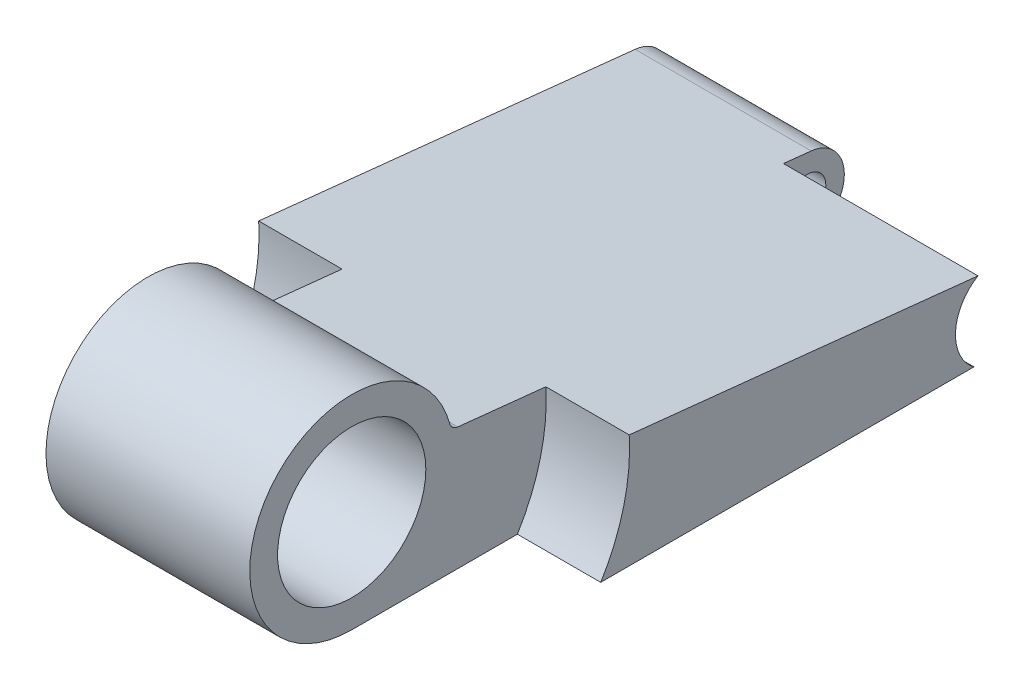
ISO-10303-21;
HEADER;
FILE_DESCRIPTION(('STEP AP214'),'2;1');
FILE_NAME('part.step','',(''),(''),'','','');
FILE_SCHEMA(('AUTOMOTIVE_DESIGN { 1 0 10303 214 1 1 1 1 }'));
ENDSEC;
DATA;
#1=APPLICATION_CONTEXT('core data for automotive mechanical design processes');
#2=APPLICATION_PROTOCOL_DEFINITION('international standard','automotive_design',2000,#1);
#3=PRODUCT_CONTEXT('',#1,'mechanical');
#4=PRODUCT('Part','Part','',(#3));
#5=PRODUCT_RELATED_PRODUCT_CATEGORY('part','',(#4));
#6=PRODUCT_DEFINITION_FORMATION('','',#4);
#7=PRODUCT_DEFINITION_CONTEXT('part definition',#1,'design');
#8=PRODUCT_DEFINITION('design','',#6,#7);
#9=PRODUCT_DEFINITION_SHAPE('','',#8);
#10=(LENGTH_UNIT() NAMED_UNIT(*) SI_UNIT(.MILLI.,.METRE.));
#11=(NAMED_UNIT(*) PLANE_ANGLE_UNIT() SI_UNIT($,.RADIAN.));
#12=(NAMED_UNIT(*) SI_UNIT($,.STERADIAN.) SOLID_ANGLE_UNIT());
#13=UNCERTAINTY_MEASURE_WITH_UNIT(LENGTH_MEASURE(1.E-05),#10,'distance_accuracy_value','');
#14=(GEOMETRIC_REPRESENTATION_CONTEXT(3) GLOBAL_UNCERTAINTY_ASSIGNED_CONTEXT((#13)) GLOBAL_UNIT_ASSIGNED_CONTEXT((#10,
#11,#12)) REPRESENTATION_CONTEXT('',''));
#15=CARTESIAN_POINT('',(0.,0.,0.));
#16=DIRECTION('',(0.,0.,1.));
#17=DIRECTION('',(1.,0.,0.));
#18=AXIS2_PLACEMENT_3D('',#15,#16,#17);
#19=CARTESIAN_POINT('',(-15.68196,-2.74447324027126,-17.8828513810992));
#20=DIRECTION('',(1.,0.,0.));
#21=DIRECTION('',(0.,0.,-1.));
#22=AXIS2_PLACEMENT_3D('',#19,#20,#21);
#23=CYLINDRICAL_SURFACE('',#22,1.56844676235245);
#24=DIRECTION('',(1.,0.,0.));
#25=VECTOR('',#24,1.);
#26=CARTESIAN_POINT('',(-15.68196,-1.18460826102359,-18.0467003751472));
#27=LINE('',#26,#25);
#28=CARTESIAN_POINT('',(-15.68196,-1.18460826102359,-18.0467003751472));
#29=VERTEX_POINT('',#28);
#30=CARTESIAN_POINT('',(-8.23214,-1.18460826102359,-18.0467003751472));
#31=VERTEX_POINT('',#30);
#32=EDGE_CURVE('E154',#29,#31,#27,.T.);
#33=ORIENTED_EDGE('',*,*,#32,.T.);
#34=CARTESIAN_POINT('',(-8.23214,-2.74447324027126,-17.8828513810992));
#35=DIRECTION('',(1.,0.,0.));
#36=DIRECTION('',(0.,0.,-1.));
#37=AXIS2_PLACEMENT_3D('',#34,#35,#36);
#38=CIRCLE('',#37,1.56844676235245);
#39=CARTESIAN_POINT('',(-8.23214,-4.31292000262371,-17.8828513810992));
#40=VERTEX_POINT('',#39);
#41=EDGE_CURVE('E221',#31,#40,#38,.F.);
#42=ORIENTED_EDGE('',*,*,#41,.T.);
#43=DIRECTION('',(1.,0.,0.));
#44=VECTOR('',#43,1.);
#45=CARTESIAN_POINT('',(-15.68196,-4.31292000262371,-17.8828513810992));
#46=LINE('',#45,#44);
#47=CARTESIAN_POINT('',(-15.68196,-4.31292000262371,-17.8828513810992));
#48=VERTEX_POINT('',#47);
#49=EDGE_CURVE('E149',#48,#40,#46,.T.);
#50=ORIENTED_EDGE('',*,*,#49,.F.);
#51=CARTESIAN_POINT('',(-15.68196,-2.74447324027126,-17.8828513810992));
#52=DIRECTION('',(1.,0.,0.));
#53=DIRECTION('',(0.,0.,-1.));
#54=AXIS2_PLACEMENT_3D('',#51,#52,#53);
#55=CIRCLE('',#54,1.56844676235245);
#56=EDGE_CURVE('E139',#48,#29,#55,.T.);
#57=ORIENTED_EDGE('',*,*,#56,.T.);
#58=EDGE_LOOP('',(#33,#42,#50,#57));
#59=FACE_BOUND('',#58,.T.);
#60=ADVANCED_FACE('F32',(#59),#23,.T.);
#61=CARTESIAN_POINT('',(-15.68196,-2.74447324027126,-17.8828513810992));
#62=DIRECTION('',(1.,0.,0.));
#63=DIRECTION('',(0.,0.,-1.));
#64=AXIS2_PLACEMENT_3D('',#61,#62,#63);
#65=CYLINDRICAL_SURFACE('',#64,0.78486);
#66=CARTESIAN_POINT('',(-15.68196,-2.74447324027126,-17.8828513810992));
#67=DIRECTION('',(1.,0.,0.));
#68=DIRECTION('',(0.,0.,-1.));
#69=AXIS2_PLACEMENT_3D('',#66,#67,#68);
#70=CIRCLE('',#69,0.78486);
#71=CARTESIAN_POINT('',(-15.68196,-2.74447324027126,-18.6677113810992));
#72=VERTEX_POINT('',#71);
#73=EDGE_CURVE('E145',#72,#72,#70,.T.);
#74=ORIENTED_EDGE('',*,*,#73,.F.);
#75=EDGE_LOOP('',(#74));
#76=FACE_BOUND('',#75,.T.);
#77=CARTESIAN_POINT('',(-8.23214,-2.74447324027126,-17.8828513810992));
#78=DIRECTION('',(1.,0.,0.));
#79=DIRECTION('',(0.,0.,-1.));
#80=AXIS2_PLACEMENT_3D('',#77,#78,#79);
#81=CIRCLE('',#80,0.78486);
#82=CARTESIAN_POINT('',(-8.23214,-2.74447324027126,-18.6677113810992));
#83=VERTEX_POINT('',#82);
#84=EDGE_CURVE('E36',#83,#83,#81,.F.);
#85=ORIENTED_EDGE('',*,*,#84,.F.);
#86=EDGE_LOOP('',(#85));
#87=FACE_BOUND('',#86,.T.);
#88=ADVANCED_FACE('F256',(#76,#87),#65,.F.);
#89=CARTESIAN_POINT('',(-15.68196,-2.62370724094478E-09,6.10208116404841));
#90=DIRECTION('',(1.,0.,0.));
#91=DIRECTION('',(0.,0.,-1.));
#92=AXIS2_PLACEMENT_3D('',#89,#90,#91);
#93=CYLINDRICAL_SURFACE('',#92,4.31292);
#94=DIRECTION('',(1.,0.,0.));
#95=VECTOR('',#94,1.);
#96=CARTESIAN_POINT('',(-15.68196,1.16479746069526,1.94942830161869));
#97=LINE('',#96,#95);
#98=CARTESIAN_POINT('',(-3.52806,1.16479746069526,1.94942830161869));
#99=VERTEX_POINT('',#98);
#100=CARTESIAN_POINT('',(-12.1539,1.16479746069526,1.94942830161869));
#101=VERTEX_POINT('',#100);
#102=EDGE_CURVE('E159',#99,#101,#97,.F.);
#103=ORIENTED_EDGE('',*,*,#102,.T.);
#104=CARTESIAN_POINT('',(-12.1539,-2.62370724094478E-09,6.10208116404841));
#105=DIRECTION('',(-1.,0.,0.));
#106=DIRECTION('',(0.,0.,1.));
#107=AXIS2_PLACEMENT_3D('',#104,#105,#106);
#108=CIRCLE('',#107,4.31292);
#109=CARTESIAN_POINT('',(-12.1539,-4.31292000262371,6.10208116404841));
#110=VERTEX_POINT('',#109);
#111=EDGE_CURVE('E186',#101,#110,#108,.F.);
#112=ORIENTED_EDGE('',*,*,#111,.T.);
#113=DIRECTION('',(1.,0.,0.));
#114=VECTOR('',#113,1.);
#115=CARTESIAN_POINT('',(-15.68196,-4.31292000262371,6.10208116404841));
#116=LINE('',#115,#114);
#117=CARTESIAN_POINT('',(-3.52806,-4.31292000262371,6.10208116404841));
#118=VERTEX_POINT('',#117);
#119=EDGE_CURVE('E152',#110,#118,#116,.T.);
#120=ORIENTED_EDGE('',*,*,#119,.T.);
#121=CARTESIAN_POINT('',(-3.52806,-2.62370724094478E-09,6.10208116404841));
#122=DIRECTION('',(1.,0.,0.));
#123=DIRECTION('',(0.,0.,-1.));
#124=AXIS2_PLACEMENT_3D('',#121,#122,#123);
#125=CIRCLE('',#124,4.31292);
#126=EDGE_CURVE('E170',#118,#99,#125,.F.);
#127=ORIENTED_EDGE('',*,*,#126,.T.);
#128=EDGE_LOOP('',(#103,#112,#120,#127));
#129=FACE_BOUND('',#128,.T.);
#130=ADVANCED_FACE('F178',(#129),#93,.T.);
#131=CARTESIAN_POINT('',(-15.68196,-2.62370724094478E-09,6.10208116404841));
#132=DIRECTION('',(1.,0.,0.));
#133=DIRECTION('',(0.,0.,-1.));
#134=AXIS2_PLACEMENT_3D('',#131,#132,#133);
#135=CYLINDRICAL_SURFACE('',#134,3.1369);
#136=CARTESIAN_POINT('',(-3.52806,-2.62370724094478E-09,6.10208116404841));
#137=DIRECTION('',(1.,0.,0.));
#138=DIRECTION('',(0.,0.,-1.));
#139=AXIS2_PLACEMENT_3D('',#136,#137,#138);
#140=CIRCLE('',#139,3.1369);
#141=CARTESIAN_POINT('',(-3.52806,-2.62370724094478E-09,2.96518116404841));
#142=VERTEX_POINT('',#141);
#143=EDGE_CURVE('E204',#142,#142,#140,.F.);
#144=ORIENTED_EDGE('',*,*,#143,.F.);
#145=EDGE_LOOP('',(#144));
#146=FACE_BOUND('',#145,.T.);
#147=CARTESIAN_POINT('',(-12.1539,-2.62370724094478E-09,6.10208116404841));
#148=DIRECTION('',(-1.,0.,0.));
#149=DIRECTION('',(0.,0.,1.));
#150=AXIS2_PLACEMENT_3D('',#147,#148,#149);
#151=CIRCLE('',#150,3.1369);
#152=CARTESIAN_POINT('',(-12.1539,-2.62370724094478E-09,9.23898116404841));
#153=VERTEX_POINT('',#152);
#154=EDGE_CURVE('E196',#153,#153,#151,.F.);
#155=ORIENTED_EDGE('',*,*,#154,.F.);
#156=EDGE_LOOP('',(#155));
#157=FACE_BOUND('',#156,.T.);
#158=ADVANCED_FACE('F267',(#146,#157),#135,.F.);
#159=CARTESIAN_POINT('',(-15.68196,1.27043869117295,1.57280371927819));
#160=DIRECTION('',(1.,0.,0.));
#161=DIRECTION('',(0.,0.,-1.));
#162=AXIS2_PLACEMENT_3D('',#159,#160,#161);
#163=CYLINDRICAL_SURFACE('',#162,0.39116);
#164=CARTESIAN_POINT('',(-12.1539,1.27043869117295,1.57280371927819));
#165=DIRECTION('',(-1.,0.,0.));
#166=DIRECTION('',(0.,0.,1.));
#167=AXIS2_PLACEMENT_3D('',#164,#165,#166);
#168=CIRCLE('',#167,0.39116);
#169=CARTESIAN_POINT('',(-12.1539,0.881420764820467,1.61368401497687));
#170=VERTEX_POINT('',#169);
#171=EDGE_CURVE('E184',#101,#170,#168,.F.);
#172=ORIENTED_EDGE('',*,*,#171,.F.);
#173=ORIENTED_EDGE('',*,*,#102,.F.);
#174=CARTESIAN_POINT('',(-3.52806,1.27043869117295,1.57280371927819));
#175=DIRECTION('',(1.,0.,0.));
#176=DIRECTION('',(0.,0.,-1.));
#177=AXIS2_PLACEMENT_3D('',#174,#175,#176);
#178=CIRCLE('',#177,0.39116);
#179=CARTESIAN_POINT('',(-3.52806,0.881420764820466,1.61368401497687));
#180=VERTEX_POINT('',#179);
#181=EDGE_CURVE('E41',#180,#99,#178,.F.);
#182=ORIENTED_EDGE('',*,*,#181,.F.);
#183=DIRECTION('',(-1.,0.,0.));
#184=VECTOR('',#183,1.);
#185=CARTESIAN_POINT('',(0.,0.881420764820466,1.61368401497687));
#186=LINE('',#185,#184);
#187=EDGE_CURVE('E151',#170,#180,#186,.F.);
#188=ORIENTED_EDGE('',*,*,#187,.F.);
#189=EDGE_LOOP('',(#172,#173,#182,#188));
#190=FACE_BOUND('',#189,.T.);
#191=ADVANCED_FACE('F34',(#190),#163,.F.);
#192=CARTESIAN_POINT('',(-15.68196,-4.31292000262371,6.10208116404841));
#193=DIRECTION('',(0.,-1.,0.));
#194=DIRECTION('',(0.,0.,-1.));
#195=AXIS2_PLACEMENT_3D('',#192,#193,#194);
#196=PLANE('',#195);
#197=DIRECTION('',(1.,0.,0.));
#198=VECTOR('',#197,1.);
#199=CARTESIAN_POINT('',(-8.23214,-4.31292000262371,-16.7059804756613));
#200=LINE('',#199,#198);
#201=CARTESIAN_POINT('',(0.,-4.31292000262371,-16.7059804756613));
#202=VERTEX_POINT('',#201);
#203=CARTESIAN_POINT('',(-8.23214,-4.31292000262371,-16.7059804756613));
#204=VERTEX_POINT('',#203);
#205=EDGE_CURVE('E118',#202,#204,#200,.F.);
#206=ORIENTED_EDGE('',*,*,#205,.F.);
#207=DIRECTION('',(0.,0.,-1.));
#208=VECTOR('',#207,1.);
#209=CARTESIAN_POINT('',(0.,-4.31292000262371,6.10208116404841));
#210=LINE('',#209,#208);
#211=CARTESIAN_POINT('',(0.,-4.31292000262371,-0.909826568744426));
#212=VERTEX_POINT('',#211);
#213=EDGE_CURVE('E130',#212,#202,#210,.T.);
#214=ORIENTED_EDGE('',*,*,#213,.F.);
#215=DIRECTION('',(1.,0.,0.));
#216=VECTOR('',#215,1.);
#217=CARTESIAN_POINT('',(-3.52806,-4.31292000262371,-0.909826568744426));
#218=LINE('',#217,#216);
#219=CARTESIAN_POINT('',(-3.52806,-4.31292000262371,-0.909826568744426));
#220=VERTEX_POINT('',#219);
#221=EDGE_CURVE('E209',#220,#212,#218,.T.);
#222=ORIENTED_EDGE('',*,*,#221,.F.);
#223=DIRECTION('',(0.,0.,1.));
#224=VECTOR('',#223,1.);
#225=CARTESIAN_POINT('',(-3.52806,-4.31292000262371,6.10208116404841));
#226=LINE('',#225,#224);
#227=EDGE_CURVE('E181',#220,#118,#226,.T.);
#228=ORIENTED_EDGE('',*,*,#227,.T.);
#229=ORIENTED_EDGE('',*,*,#119,.F.);
#230=DIRECTION('',(0.,0.,-1.));
#231=VECTOR('',#230,1.);
#232=CARTESIAN_POINT('',(-12.1539,-4.31292000262371,6.10208116404841));
#233=LINE('',#232,#231);
#234=CARTESIAN_POINT('',(-12.1539,-4.31292000262371,-0.909826568744426));
#235=VERTEX_POINT('',#234);
#236=EDGE_CURVE('E189',#110,#235,#233,.T.);
#237=ORIENTED_EDGE('',*,*,#236,.T.);
#238=DIRECTION('',(-1.,0.,0.));
#239=VECTOR('',#238,1.);
#240=CARTESIAN_POINT('',(-12.1539,-4.31292000262371,-0.909826568744426));
#241=LINE('',#240,#239);
#242=CARTESIAN_POINT('',(-15.68196,-4.31292000262371,-0.909826568744426));
#243=VERTEX_POINT('',#242);
#244=EDGE_CURVE('E187',#243,#235,#241,.F.);
#245=ORIENTED_EDGE('',*,*,#244,.F.);
#246=DIRECTION('',(0.,0.,-1.));
#247=VECTOR('',#246,1.);
#248=CARTESIAN_POINT('',(-15.68196,-4.31292000262371,6.10208116404841));
#249=LINE('',#248,#247);
#250=EDGE_CURVE('E157',#243,#48,#249,.T.);
#251=ORIENTED_EDGE('',*,*,#250,.T.);
#252=ORIENTED_EDGE('',*,*,#49,.T.);
#253=DIRECTION('',(0.,0.,1.));
#254=VECTOR('',#253,1.);
#255=CARTESIAN_POINT('',(-8.23214,-4.31292000262371,6.10208116404841));
#256=LINE('',#255,#254);
#257=EDGE_CURVE('E132',#40,#204,#256,.T.);
#258=ORIENTED_EDGE('',*,*,#257,.T.);
#259=EDGE_LOOP('',(#206,#214,#222,#228,#229,#237,#245,#251,#252,#258));
#260=FACE_BOUND('',#259,.T.);
#261=ADVANCED_FACE('F128',(#260),#196,.T.);
#262=CARTESIAN_POINT('',(-15.68196,-1.18460826102359,-18.0467003751472));
#263=DIRECTION('',(0.,0.994523791677285,-0.104510419518038));
#264=DIRECTION('',(0.,0.104510419518038,0.994523791677285));
#265=AXIS2_PLACEMENT_3D('',#262,#263,#264);
#266=PLANE('',#265);
#267=DIRECTION('',(1.,0.,0.));
#268=VECTOR('',#267,1.);
#269=CARTESIAN_POINT('',(-8.23214,-1.06162034843868,-16.876344292773));
#270=LINE('',#269,#268);
#271=CARTESIAN_POINT('',(-8.23214,-1.06162034843868,-16.876344292773));
#272=VERTEX_POINT('',#271);
#273=CARTESIAN_POINT('',(0.,-1.06162034843869,-16.876344292773));
#274=VERTEX_POINT('',#273);
#275=EDGE_CURVE('E48',#272,#274,#270,.T.);
#276=ORIENTED_EDGE('',*,*,#275,.F.);
#277=DIRECTION('',(0.,-0.104510419518038,-0.994523791677285));
#278=VECTOR('',#277,1.);
#279=CARTESIAN_POINT('',(-8.23214,-1.18460826102359,-18.0467003751472));
#280=LINE('',#279,#278);
#281=EDGE_CURVE('E227',#272,#31,#280,.T.);
#282=ORIENTED_EDGE('',*,*,#281,.T.);
#283=ORIENTED_EDGE('',*,*,#32,.F.);
#284=DIRECTION('',(0.,0.104510419518038,0.994523791677285));
#285=VECTOR('',#284,1.);
#286=CARTESIAN_POINT('',(-15.68196,-1.18460826102359,-18.0467003751472));
#287=LINE('',#286,#285);
#288=CARTESIAN_POINT('',(-15.68196,0.489537146244621,-2.11549039691033));
#289=VERTEX_POINT('',#288);
#290=EDGE_CURVE('E143',#29,#289,#287,.T.);
#291=ORIENTED_EDGE('',*,*,#290,.T.);
#292=DIRECTION('',(-1.,0.,0.));
#293=VECTOR('',#292,1.);
#294=CARTESIAN_POINT('',(-12.1539,0.489537146244622,-2.11549039691033));
#295=LINE('',#294,#293);
#296=CARTESIAN_POINT('',(-12.1539,0.489537146244622,-2.11549039691033));
#297=VERTEX_POINT('',#296);
#298=EDGE_CURVE('E56',#297,#289,#295,.T.);
#299=ORIENTED_EDGE('',*,*,#298,.F.);
#300=DIRECTION('',(0.,0.104510419518038,0.994523791677285));
#301=VECTOR('',#300,1.);
#302=CARTESIAN_POINT('',(-12.1539,-1.18460826102359,-18.0467003751472));
#303=LINE('',#302,#301);
#304=EDGE_CURVE('E11',#297,#170,#303,.T.);
#305=ORIENTED_EDGE('',*,*,#304,.T.);
#306=ORIENTED_EDGE('',*,*,#187,.T.);
#307=DIRECTION('',(0.,-0.104510419518038,-0.994523791677285));
#308=VECTOR('',#307,1.);
#309=CARTESIAN_POINT('',(-3.52806,-1.18460826102359,-18.0467003751472));
#310=LINE('',#309,#308);
#311=CARTESIAN_POINT('',(-3.52806,0.489537146244622,-2.11549039691033));
#312=VERTEX_POINT('',#311);
#313=EDGE_CURVE('E173',#180,#312,#310,.T.);
#314=ORIENTED_EDGE('',*,*,#313,.T.);
#315=DIRECTION('',(1.,0.,0.));
#316=VECTOR('',#315,1.);
#317=CARTESIAN_POINT('',(-3.52806,0.489537146244622,-2.11549039691033));
#318=LINE('',#317,#316);
#319=CARTESIAN_POINT('',(0.,0.489537146244621,-2.11549039691033));
#320=VERTEX_POINT('',#319);
#321=EDGE_CURVE('E207',#320,#312,#318,.F.);
#322=ORIENTED_EDGE('',*,*,#321,.F.);
#323=DIRECTION('',(0.,0.104510419518038,0.994523791677285));
#324=VECTOR('',#323,1.);
#325=CARTESIAN_POINT('',(0.,-1.18460826102359,-18.0467003751472));
#326=LINE('',#325,#324);
#327=EDGE_CURVE('E140',#274,#320,#326,.T.);
#328=ORIENTED_EDGE('',*,*,#327,.F.);
#329=EDGE_LOOP('',(#276,#282,#283,#291,#299,#305,#306,#314,#322,#328));
#330=FACE_BOUND('',#329,.T.);
#331=ADVANCED_FACE('F225',(#330),#266,.T.);
#332=CARTESIAN_POINT('',(-15.68196,-2.74447324027126,-17.8828513810992));
#333=DIRECTION('',(1.,0.,0.));
#334=DIRECTION('',(0.,0.,-1.));
#335=AXIS2_PLACEMENT_3D('',#332,#333,#334);
#336=PLANE('',#335);
#337=ORIENTED_EDGE('',*,*,#73,.T.);
#338=EDGE_LOOP('',(#337));
#339=FACE_BOUND('',#338,.T.);
#340=ORIENTED_EDGE('',*,*,#250,.F.);
#341=CARTESIAN_POINT('',(-15.68196,-2.62370724094478E-09,6.10208116404841));
#342=DIRECTION('',(-1.,0.,0.));
#343=DIRECTION('',(0.,0.,1.));
#344=AXIS2_PLACEMENT_3D('',#341,#342,#343);
#345=CIRCLE('',#344,8.23214);
#346=EDGE_CURVE('E133',#289,#243,#345,.T.);
#347=ORIENTED_EDGE('',*,*,#346,.F.);
#348=ORIENTED_EDGE('',*,*,#290,.F.);
#349=ORIENTED_EDGE('',*,*,#56,.F.);
#350=EDGE_LOOP('',(#340,#347,#348,#349));
#351=FACE_BOUND('',#350,.T.);
#352=ADVANCED_FACE('F223',(#339,#351),#336,.F.);
#353=CARTESIAN_POINT('',(0.,-2.74447324027126,-17.8828513810992));
#354=DIRECTION('',(1.,0.,0.));
#355=DIRECTION('',(0.,0.,-1.));
#356=AXIS2_PLACEMENT_3D('',#353,#354,#355);
#357=PLANE('',#356);
#358=CARTESIAN_POINT('',(0.,-2.74447324027126,-17.8828513810992));
#359=DIRECTION('',(1.,0.,0.));
#360=DIRECTION('',(0.,0.,-1.));
#361=AXIS2_PLACEMENT_3D('',#358,#359,#360);
#362=CIRCLE('',#361,1.96088);
#363=EDGE_CURVE('E115',#274,#202,#362,.T.);
#364=ORIENTED_EDGE('',*,*,#363,.F.);
#365=ORIENTED_EDGE('',*,*,#327,.T.);
#366=CARTESIAN_POINT('',(0.,-2.62370724094478E-09,6.10208116404841));
#367=DIRECTION('',(1.,0.,0.));
#368=DIRECTION('',(0.,0.,-1.));
#369=AXIS2_PLACEMENT_3D('',#366,#367,#368);
#370=CIRCLE('',#369,8.23214);
#371=EDGE_CURVE('E138',#212,#320,#370,.T.);
#372=ORIENTED_EDGE('',*,*,#371,.F.);
#373=ORIENTED_EDGE('',*,*,#213,.T.);
#374=EDGE_LOOP('',(#364,#365,#372,#373));
#375=FACE_BOUND('',#374,.T.);
#376=ADVANCED_FACE('F136',(#375),#357,.T.);
#377=CARTESIAN_POINT('',(-3.52806,-2.62370724094478E-09,6.10208116404841));
#378=DIRECTION('',(1.,0.,0.));
#379=DIRECTION('',(0.,0.,-1.));
#380=AXIS2_PLACEMENT_3D('',#377,#378,#379);
#381=PLANE('',#380);
#382=CARTESIAN_POINT('',(-3.52806,-2.62370724094478E-09,6.10208116404841));
#383=DIRECTION('',(1.,0.,0.));
#384=DIRECTION('',(0.,0.,-1.));
#385=AXIS2_PLACEMENT_3D('',#382,#383,#384);
#386=CIRCLE('',#385,8.23214);
#387=EDGE_CURVE('E199',#220,#312,#386,.T.);
#388=ORIENTED_EDGE('',*,*,#387,.T.);
#389=ORIENTED_EDGE('',*,*,#313,.F.);
#390=ORIENTED_EDGE('',*,*,#181,.T.);
#391=ORIENTED_EDGE('',*,*,#126,.F.);
#392=ORIENTED_EDGE('',*,*,#227,.F.);
#393=EDGE_LOOP('',(#388,#389,#390,#391,#392));
#394=FACE_BOUND('',#393,.T.);
#395=ORIENTED_EDGE('',*,*,#143,.T.);
#396=EDGE_LOOP('',(#395));
#397=FACE_BOUND('',#396,.T.);
#398=ADVANCED_FACE('F168',(#394,#397),#381,.T.);
#399=CARTESIAN_POINT('',(-3.52806,-2.62370724094478E-09,6.10208116404841));
#400=DIRECTION('',(1.,0.,0.));
#401=DIRECTION('',(0.,0.,-1.));
#402=AXIS2_PLACEMENT_3D('',#399,#400,#401);
#403=CYLINDRICAL_SURFACE('',#402,8.23214);
#404=ORIENTED_EDGE('',*,*,#221,.T.);
#405=ORIENTED_EDGE('',*,*,#371,.T.);
#406=ORIENTED_EDGE('',*,*,#321,.T.);
#407=ORIENTED_EDGE('',*,*,#387,.F.);
#408=EDGE_LOOP('',(#404,#405,#406,#407));
#409=FACE_BOUND('',#408,.T.);
#410=ADVANCED_FACE('F244',(#409),#403,.F.);
#411=CARTESIAN_POINT('',(-12.1539,-2.62370724094478E-09,6.10208116404841));
#412=DIRECTION('',(-1.,0.,0.));
#413=DIRECTION('',(0.,0.,1.));
#414=AXIS2_PLACEMENT_3D('',#411,#412,#413);
#415=PLANE('',#414);
#416=ORIENTED_EDGE('',*,*,#111,.F.);
#417=ORIENTED_EDGE('',*,*,#171,.T.);
#418=ORIENTED_EDGE('',*,*,#304,.F.);
#419=CARTESIAN_POINT('',(-12.1539,-2.62370724094478E-09,6.10208116404841));
#420=DIRECTION('',(-1.,0.,0.));
#421=DIRECTION('',(0.,0.,1.));
#422=AXIS2_PLACEMENT_3D('',#419,#420,#421);
#423=CIRCLE('',#422,8.23214);
#424=EDGE_CURVE('E236',#297,#235,#423,.T.);
#425=ORIENTED_EDGE('',*,*,#424,.T.);
#426=ORIENTED_EDGE('',*,*,#236,.F.);
#427=EDGE_LOOP('',(#416,#417,#418,#425,#426));
#428=FACE_BOUND('',#427,.T.);
#429=ORIENTED_EDGE('',*,*,#154,.T.);
#430=EDGE_LOOP('',(#429));
#431=FACE_BOUND('',#430,.T.);
#432=ADVANCED_FACE('F240',(#428,#431),#415,.T.);
#433=CARTESIAN_POINT('',(-12.1539,-2.62370724094478E-09,6.10208116404841));
#434=DIRECTION('',(-1.,0.,0.));
#435=DIRECTION('',(0.,0.,1.));
#436=AXIS2_PLACEMENT_3D('',#433,#434,#435);
#437=CYLINDRICAL_SURFACE('',#436,8.23214);
#438=ORIENTED_EDGE('',*,*,#244,.T.);
#439=ORIENTED_EDGE('',*,*,#424,.F.);
#440=ORIENTED_EDGE('',*,*,#298,.T.);
#441=ORIENTED_EDGE('',*,*,#346,.T.);
#442=EDGE_LOOP('',(#438,#439,#440,#441));
#443=FACE_BOUND('',#442,.T.);
#444=ADVANCED_FACE('F239',(#443),#437,.F.);
#445=CARTESIAN_POINT('',(-8.23214,-2.74447324027126,-17.8828513810992));
#446=DIRECTION('',(1.,0.,0.));
#447=DIRECTION('',(0.,0.,-1.));
#448=AXIS2_PLACEMENT_3D('',#445,#446,#447);
#449=PLANE('',#448);
#450=ORIENTED_EDGE('',*,*,#41,.F.);
#451=ORIENTED_EDGE('',*,*,#281,.F.);
#452=CARTESIAN_POINT('',(-8.23214,-2.74447324027126,-17.8828513810992));
#453=DIRECTION('',(1.,0.,0.));
#454=DIRECTION('',(0.,0.,-1.));
#455=AXIS2_PLACEMENT_3D('',#452,#453,#454);
#456=CIRCLE('',#455,1.96088);
#457=EDGE_CURVE('E123',#272,#204,#456,.T.);
#458=ORIENTED_EDGE('',*,*,#457,.T.);
#459=ORIENTED_EDGE('',*,*,#257,.F.);
#460=EDGE_LOOP('',(#450,#451,#458,#459));
#461=FACE_BOUND('',#460,.T.);
#462=ORIENTED_EDGE('',*,*,#84,.T.);
#463=EDGE_LOOP('',(#462));
#464=FACE_BOUND('',#463,.T.);
#465=ADVANCED_FACE('F342',(#461,#464),#449,.T.);
#466=CARTESIAN_POINT('',(-8.23214,-2.74447324027126,-17.8828513810992));
#467=DIRECTION('',(1.,0.,0.));
#468=DIRECTION('',(0.,0.,-1.));
#469=AXIS2_PLACEMENT_3D('',#466,#467,#468);
#470=CYLINDRICAL_SURFACE('',#469,1.96088);
#471=ORIENTED_EDGE('',*,*,#205,.T.);
#472=ORIENTED_EDGE('',*,*,#457,.F.);
#473=ORIENTED_EDGE('',*,*,#275,.T.);
#474=ORIENTED_EDGE('',*,*,#363,.T.);
#475=EDGE_LOOP('',(#471,#472,#473,#474));
#476=FACE_BOUND('',#475,.T.);
#477=ADVANCED_FACE('F117',(#476),#470,.F.);
#478=CLOSED_SHELL('',(#60,#88,#130,#158,#191,#261,#331,#352,#376,#398,#410,#432,#444,#465,#477));
#479=MANIFOLD_SOLID_BREP('B2',#478);
#480=ADVANCED_BREP_SHAPE_REPRESENTATION('',(#18,#479),#14);
#481=SHAPE_DEFINITION_REPRESENTATION(#9,#480);
ENDSEC;
END-ISO-10303-21;
